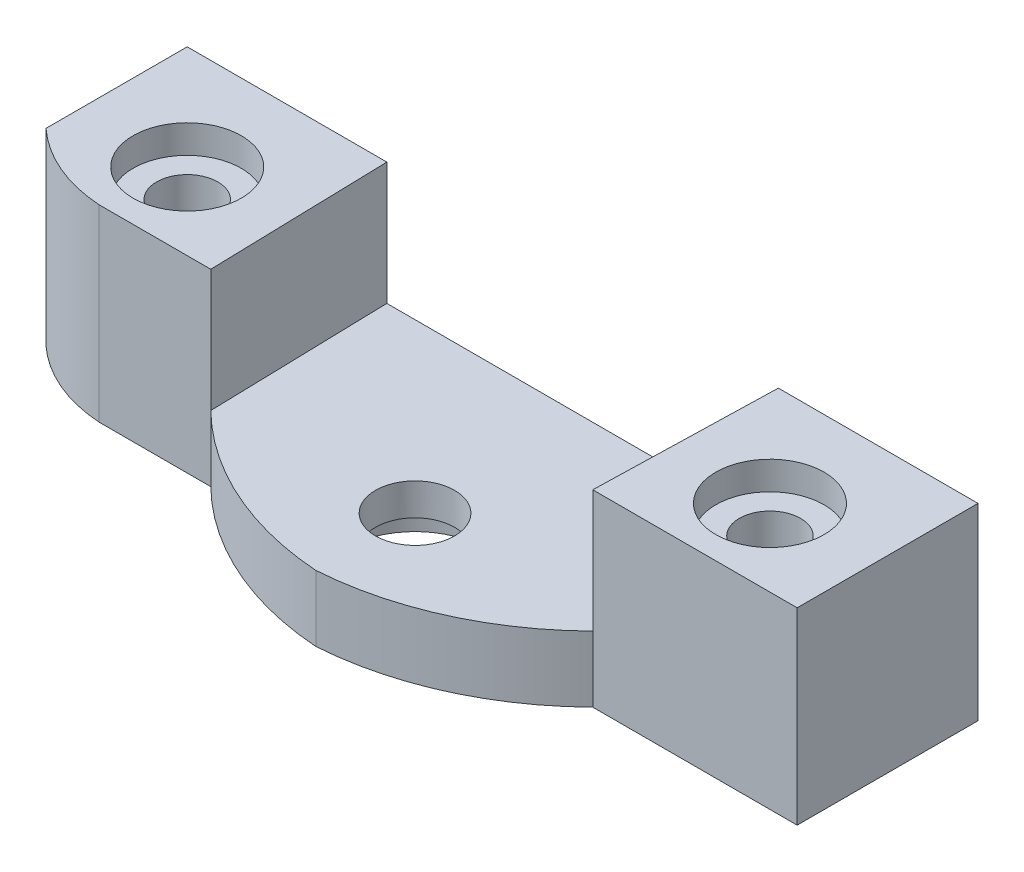
ISO-10303-21;
HEADER;
FILE_DESCRIPTION(('STEP AP214'),'2;1');
FILE_NAME('part.step','',(''),(''),'','','');
FILE_SCHEMA(('AUTOMOTIVE_DESIGN { 1 0 10303 214 1 1 1 1 }'));
ENDSEC;
DATA;
#1=APPLICATION_CONTEXT('core data for automotive mechanical design processes');
#2=APPLICATION_PROTOCOL_DEFINITION('international standard','automotive_design',2000,#1);
#3=PRODUCT_CONTEXT('',#1,'mechanical');
#4=PRODUCT('Part','Part','',(#3));
#5=PRODUCT_RELATED_PRODUCT_CATEGORY('part','',(#4));
#6=PRODUCT_DEFINITION_FORMATION('','',#4);
#7=PRODUCT_DEFINITION_CONTEXT('part definition',#1,'design');
#8=PRODUCT_DEFINITION('design','',#6,#7);
#9=PRODUCT_DEFINITION_SHAPE('','',#8);
#10=(LENGTH_UNIT() NAMED_UNIT(*) SI_UNIT(.MILLI.,.METRE.));
#11=(NAMED_UNIT(*) PLANE_ANGLE_UNIT() SI_UNIT($,.RADIAN.));
#12=(NAMED_UNIT(*) SI_UNIT($,.STERADIAN.) SOLID_ANGLE_UNIT());
#13=UNCERTAINTY_MEASURE_WITH_UNIT(LENGTH_MEASURE(1.E-05),#10,'distance_accuracy_value','');
#14=(GEOMETRIC_REPRESENTATION_CONTEXT(3) GLOBAL_UNCERTAINTY_ASSIGNED_CONTEXT((#13)) GLOBAL_UNIT_ASSIGNED_CONTEXT((#10,
#11,#12)) REPRESENTATION_CONTEXT('',''));
#15=CARTESIAN_POINT('',(0.,0.,0.));
#16=DIRECTION('',(0.,0.,1.));
#17=DIRECTION('',(1.,0.,0.));
#18=AXIS2_PLACEMENT_3D('',#15,#16,#17);
#19=CARTESIAN_POINT('',(0.,-0.999999999999999,3.9));
#20=DIRECTION('',(0.,1.,0.));
#21=DIRECTION('',(0.,0.,1.));
#22=AXIS2_PLACEMENT_3D('',#19,#20,#21);
#23=CYLINDRICAL_SURFACE('',#22,2.1);
#24=CARTESIAN_POINT('',(0.,3.5,3.9));
#25=DIRECTION('',(0.,1.,0.));
#26=DIRECTION('',(0.,0.,1.));
#27=AXIS2_PLACEMENT_3D('',#24,#25,#26);
#28=CIRCLE('',#27,2.1);
#29=CARTESIAN_POINT('',(0.,3.5,6.));
#30=VERTEX_POINT('',#29);
#31=EDGE_CURVE('E243',#30,#30,#28,.T.);
#32=ORIENTED_EDGE('',*,*,#31,.T.);
#33=EDGE_LOOP('',(#32));
#34=FACE_BOUND('',#33,.T.);
#35=CARTESIAN_POINT('',(0.,1.8,3.9));
#36=DIRECTION('',(0.,-1.,0.));
#37=DIRECTION('',(0.,0.,-1.));
#38=AXIS2_PLACEMENT_3D('',#35,#36,#37);
#39=CIRCLE('',#38,2.1);
#40=CARTESIAN_POINT('',(0.,1.8,1.8));
#41=VERTEX_POINT('',#40);
#42=EDGE_CURVE('E49',#41,#41,#39,.F.);
#43=ORIENTED_EDGE('',*,*,#42,.F.);
#44=EDGE_LOOP('',(#43));
#45=FACE_BOUND('',#44,.T.);
#46=ADVANCED_FACE('F45',(#34,#45),#23,.F.);
#47=CARTESIAN_POINT('',(0.,10.,0.));
#48=DIRECTION('',(0.,1.,0.));
#49=DIRECTION('',(0.,0.,1.));
#50=AXIS2_PLACEMENT_3D('',#47,#48,#49);
#51=PLANE('',#50);
#52=CARTESIAN_POINT('',(-15.475,10.,0.525));
#53=DIRECTION('',(0.,1.,0.));
#54=DIRECTION('',(0.,0.,1.));
#55=AXIS2_PLACEMENT_3D('',#52,#53,#54);
#56=CIRCLE('',#55,2.875);
#57=CARTESIAN_POINT('',(-15.475,10.,3.4));
#58=VERTEX_POINT('',#57);
#59=EDGE_CURVE('E209',#58,#58,#56,.T.);
#60=ORIENTED_EDGE('',*,*,#59,.F.);
#61=EDGE_LOOP('',(#60));
#62=FACE_BOUND('',#61,.T.);
#63=CARTESIAN_POINT('',(-15.5717814537107,10.,-3.3865068060365));
#64=DIRECTION('',(0.,-1.,0.));
#65=DIRECTION('',(0.,0.,-1.));
#66=AXIS2_PLACEMENT_3D('',#63,#64,#65);
#67=CIRCLE('',#66,8.00722567245859);
#68=CARTESIAN_POINT('',(-16.0708105718803,10.,4.60515340376339));
#69=VERTEX_POINT('',#68);
#70=CARTESIAN_POINT('',(-21.,10.,2.49992729139473));
#71=VERTEX_POINT('',#70);
#72=EDGE_CURVE('E62',#69,#71,#67,.T.);
#73=ORIENTED_EDGE('',*,*,#72,.F.);
#74=DIRECTION('',(1.,0.,0.));
#75=VECTOR('',#74,1.);
#76=CARTESIAN_POINT('',(0.,10.,4.60515340376339));
#77=LINE('',#76,#75);
#78=CARTESIAN_POINT('',(-10.1444972737664,10.,4.60515340376339));
#79=VERTEX_POINT('',#78);
#80=EDGE_CURVE('E145',#69,#79,#77,.T.);
#81=ORIENTED_EDGE('',*,*,#80,.T.);
#82=DIRECTION('',(-0.026249488815985,0.,-0.999655422801727));
#83=VECTOR('',#82,1.);
#84=CARTESIAN_POINT('',(-10.2583486226296,10.,0.269369225933365));
#85=LINE('',#84,#83);
#86=CARTESIAN_POINT('',(-10.3967145489363,10.,-5.));
#87=VERTEX_POINT('',#86);
#88=EDGE_CURVE('E216',#79,#87,#85,.T.);
#89=ORIENTED_EDGE('',*,*,#88,.T.);
#90=DIRECTION('',(-1.,0.,0.));
#91=VECTOR('',#90,1.);
#92=CARTESIAN_POINT('',(-21.,10.,-5.));
#93=LINE('',#92,#91);
#94=CARTESIAN_POINT('',(-21.,10.,-5.));
#95=VERTEX_POINT('',#94);
#96=EDGE_CURVE('E174',#87,#95,#93,.T.);
#97=ORIENTED_EDGE('',*,*,#96,.T.);
#98=DIRECTION('',(0.,0.,1.));
#99=VECTOR('',#98,1.);
#100=CARTESIAN_POINT('',(-21.,10.,-5.));
#101=LINE('',#100,#99);
#102=EDGE_CURVE('E179',#95,#71,#101,.T.);
#103=ORIENTED_EDGE('',*,*,#102,.T.);
#104=EDGE_LOOP('',(#73,#81,#89,#97,#103));
#105=FACE_BOUND('',#104,.T.);
#106=ADVANCED_FACE('F264',(#62,#105),#51,.T.);
#107=CARTESIAN_POINT('',(0.,0.,0.));
#108=DIRECTION('',(0.,1.,0.));
#109=DIRECTION('',(0.,0.,1.));
#110=AXIS2_PLACEMENT_3D('',#107,#108,#109);
#111=PLANE('',#110);
#112=CARTESIAN_POINT('',(0.,0.,3.9));
#113=DIRECTION('',(0.,-1.,0.));
#114=DIRECTION('',(0.,0.,-1.));
#115=AXIS2_PLACEMENT_3D('',#112,#113,#114);
#116=CIRCLE('',#115,3.75);
#117=CARTESIAN_POINT('',(0.,0.,0.149999999999999));
#118=VERTEX_POINT('',#117);
#119=EDGE_CURVE('E251',#118,#118,#116,.T.);
#120=ORIENTED_EDGE('',*,*,#119,.F.);
#121=EDGE_LOOP('',(#120));
#122=FACE_BOUND('',#121,.T.);
#123=CARTESIAN_POINT('',(15.475,0.,0.525));
#124=DIRECTION('',(0.,1.,0.));
#125=DIRECTION('',(0.,0.,1.));
#126=AXIS2_PLACEMENT_3D('',#123,#124,#125);
#127=CIRCLE('',#126,1.625);
#128=CARTESIAN_POINT('',(15.475,0.,2.15));
#129=VERTEX_POINT('',#128);
#130=EDGE_CURVE('E165',#129,#129,#127,.T.);
#131=ORIENTED_EDGE('',*,*,#130,.T.);
#132=EDGE_LOOP('',(#131));
#133=FACE_BOUND('',#132,.T.);
#134=CARTESIAN_POINT('',(-15.475,0.,0.525));
#135=DIRECTION('',(0.,1.,0.));
#136=DIRECTION('',(0.,0.,1.));
#137=AXIS2_PLACEMENT_3D('',#134,#135,#136);
#138=CIRCLE('',#137,1.625);
#139=CARTESIAN_POINT('',(-15.475,0.,2.15));
#140=VERTEX_POINT('',#139);
#141=EDGE_CURVE('E168',#140,#140,#138,.T.);
#142=ORIENTED_EDGE('',*,*,#141,.T.);
#143=EDGE_LOOP('',(#142));
#144=FACE_BOUND('',#143,.T.);
#145=DIRECTION('',(1.,0.,0.));
#146=VECTOR('',#145,1.);
#147=CARTESIAN_POINT('',(0.,0.,4.60515340376339));
#148=LINE('',#147,#146);
#149=CARTESIAN_POINT('',(-16.0708105718803,0.,4.60515340376339));
#150=VERTEX_POINT('',#149);
#151=CARTESIAN_POINT('',(-10.1444972737664,0.,4.60515340376339));
#152=VERTEX_POINT('',#151);
#153=EDGE_CURVE('E142',#150,#152,#148,.T.);
#154=ORIENTED_EDGE('',*,*,#153,.F.);
#155=CARTESIAN_POINT('',(-15.5717814537107,0.,-3.3865068060365));
#156=DIRECTION('',(0.,-1.,0.));
#157=DIRECTION('',(0.,0.,-1.));
#158=AXIS2_PLACEMENT_3D('',#155,#156,#157);
#159=CIRCLE('',#158,8.00722567245859);
#160=CARTESIAN_POINT('',(-21.,0.,2.49992729139473));
#161=VERTEX_POINT('',#160);
#162=EDGE_CURVE('E129',#150,#161,#159,.T.);
#163=ORIENTED_EDGE('',*,*,#162,.T.);
#164=DIRECTION('',(0.,0.,1.));
#165=VECTOR('',#164,1.);
#166=CARTESIAN_POINT('',(-21.,0.,-5.));
#167=LINE('',#166,#165);
#168=CARTESIAN_POINT('',(-21.,0.,-5.));
#169=VERTEX_POINT('',#168);
#170=EDGE_CURVE('E175',#169,#161,#167,.T.);
#171=ORIENTED_EDGE('',*,*,#170,.F.);
#172=DIRECTION('',(-1.,0.,0.));
#173=VECTOR('',#172,1.);
#174=CARTESIAN_POINT('',(-21.,0.,-5.));
#175=LINE('',#174,#173);
#176=CARTESIAN_POINT('',(21.,0.,-5.));
#177=VERTEX_POINT('',#176);
#178=EDGE_CURVE('E183',#177,#169,#175,.T.);
#179=ORIENTED_EDGE('',*,*,#178,.F.);
#180=DIRECTION('',(0.,0.,-1.));
#181=VECTOR('',#180,1.);
#182=CARTESIAN_POINT('',(21.,0.,-5.));
#183=LINE('',#182,#181);
#184=CARTESIAN_POINT('',(21.0000000000001,0.,4.60515340376319));
#185=VERTEX_POINT('',#184);
#186=EDGE_CURVE('E171',#185,#177,#183,.T.);
#187=ORIENTED_EDGE('',*,*,#186,.F.);
#188=DIRECTION('',(1.,0.,0.));
#189=VECTOR('',#188,1.);
#190=CARTESIAN_POINT('',(0.,0.,4.60515340376339));
#191=LINE('',#190,#189);
#192=CARTESIAN_POINT('',(10.1444972737664,0.,4.6051534037633));
#193=VERTEX_POINT('',#192);
#194=EDGE_CURVE('E161',#193,#185,#191,.T.);
#195=ORIENTED_EDGE('',*,*,#194,.F.);
#196=CARTESIAN_POINT('',(-1.09259437558827,0.,-6.82328402604807));
#197=DIRECTION('',(0.,1.,0.));
#198=DIRECTION('',(0.,0.,1.));
#199=AXIS2_PLACEMENT_3D('',#196,#197,#198);
#200=CIRCLE('',#199,16.0275204202994);
#201=CARTESIAN_POINT('',(0.,0.,9.16695200577911));
#202=VERTEX_POINT('',#201);
#203=EDGE_CURVE('E240',#202,#193,#200,.T.);
#204=ORIENTED_EDGE('',*,*,#203,.F.);
#205=CARTESIAN_POINT('',(1.09259437558826,0.,-6.82328402604807));
#206=DIRECTION('',(0.,1.,0.));
#207=DIRECTION('',(0.,0.,-1.));
#208=AXIS2_PLACEMENT_3D('',#205,#206,#207);
#209=CIRCLE('',#208,16.0275204202993);
#210=EDGE_CURVE('E150',#152,#202,#209,.T.);
#211=ORIENTED_EDGE('',*,*,#210,.F.);
#212=EDGE_LOOP('',(#154,#163,#171,#179,#187,#195,#204,#211));
#213=FACE_BOUND('',#212,.T.);
#214=ADVANCED_FACE('F148',(#122,#133,#144,#213),#111,.F.);
#215=CARTESIAN_POINT('',(21.0000000000001,13.5,4.60515340376319));
#216=DIRECTION('',(0.,0.,1.));
#217=DIRECTION('',(1.,0.,0.));
#218=AXIS2_PLACEMENT_3D('',#215,#216,#217);
#219=PLANE('',#218);
#220=DIRECTION('',(0.,1.,0.));
#221=VECTOR('',#220,1.);
#222=CARTESIAN_POINT('',(10.1444972737663,3.5,4.6051534037633));
#223=LINE('',#222,#221);
#224=CARTESIAN_POINT('',(10.1444972737665,10.,4.60515340376324));
#225=VERTEX_POINT('',#224);
#226=CARTESIAN_POINT('',(10.1444972737663,3.5,4.6051534037633));
#227=VERTEX_POINT('',#226);
#228=EDGE_CURVE('E151',#225,#227,#223,.F.);
#229=ORIENTED_EDGE('',*,*,#228,.T.);
#230=DIRECTION('',(0.,-1.,0.));
#231=VECTOR('',#230,1.);
#232=CARTESIAN_POINT('',(10.1444972737664,3.5,4.6051534037636));
#233=LINE('',#232,#231);
#234=EDGE_CURVE('E70',#227,#193,#233,.T.);
#235=ORIENTED_EDGE('',*,*,#234,.T.);
#236=ORIENTED_EDGE('',*,*,#194,.T.);
#237=DIRECTION('',(0.,-1.,0.));
#238=VECTOR('',#237,1.);
#239=CARTESIAN_POINT('',(21.0000000000001,13.5,4.60515340376319));
#240=LINE('',#239,#238);
#241=CARTESIAN_POINT('',(21.0000000000001,10.,4.60515340376319));
#242=VERTEX_POINT('',#241);
#243=EDGE_CURVE('E193',#242,#185,#240,.T.);
#244=ORIENTED_EDGE('',*,*,#243,.F.);
#245=DIRECTION('',(1.,0.,0.));
#246=VECTOR('',#245,1.);
#247=CARTESIAN_POINT('',(0.,10.,4.60515340376339));
#248=LINE('',#247,#246);
#249=EDGE_CURVE('E153',#225,#242,#248,.T.);
#250=ORIENTED_EDGE('',*,*,#249,.F.);
#251=EDGE_LOOP('',(#229,#235,#236,#244,#250));
#252=FACE_BOUND('',#251,.T.);
#253=ADVANCED_FACE('F313',(#252),#219,.T.);
#254=CARTESIAN_POINT('',(-21.,13.5,4.60515340376339));
#255=DIRECTION('',(0.,0.,1.));
#256=DIRECTION('',(1.,0.,0.));
#257=AXIS2_PLACEMENT_3D('',#254,#255,#256);
#258=PLANE('',#257);
#259=DIRECTION('',(0.,1.,0.));
#260=VECTOR('',#259,1.);
#261=CARTESIAN_POINT('',(-16.0708105718803,0.,4.60515340376339));
#262=LINE('',#261,#260);
#263=EDGE_CURVE('E132',#150,#69,#262,.T.);
#264=ORIENTED_EDGE('',*,*,#263,.F.);
#265=ORIENTED_EDGE('',*,*,#153,.T.);
#266=DIRECTION('',(0.,-1.,0.));
#267=VECTOR('',#266,1.);
#268=CARTESIAN_POINT('',(-10.1444972737664,3.5,4.60515340376339));
#269=LINE('',#268,#267);
#270=CARTESIAN_POINT('',(-10.1444972737664,3.5,4.60515340376339));
#271=VERTEX_POINT('',#270);
#272=EDGE_CURVE('E232',#271,#152,#269,.T.);
#273=ORIENTED_EDGE('',*,*,#272,.F.);
#274=DIRECTION('',(0.,1.,0.));
#275=VECTOR('',#274,1.);
#276=CARTESIAN_POINT('',(-10.1444972737664,3.5,4.60515340376339));
#277=LINE('',#276,#275);
#278=EDGE_CURVE('E155',#271,#79,#277,.T.);
#279=ORIENTED_EDGE('',*,*,#278,.T.);
#280=ORIENTED_EDGE('',*,*,#80,.F.);
#281=EDGE_LOOP('',(#264,#265,#273,#279,#280));
#282=FACE_BOUND('',#281,.T.);
#283=ADVANCED_FACE('F141',(#282),#258,.T.);
#284=CARTESIAN_POINT('',(15.475,10.,0.524999999999869));
#285=DIRECTION('',(0.,1.,0.));
#286=DIRECTION('',(0.,0.,-1.));
#287=AXIS2_PLACEMENT_3D('',#284,#285,#286);
#288=CIRCLE('',#287,2.875);
#289=CARTESIAN_POINT('',(15.475,10.,-2.35000000000013));
#290=VERTEX_POINT('',#289);
#291=EDGE_CURVE('E205',#290,#290,#288,.T.);
#292=ORIENTED_EDGE('',*,*,#291,.F.);
#293=EDGE_LOOP('',(#292));
#294=FACE_BOUND('',#293,.T.);
#295=CARTESIAN_POINT('',(21.,10.,-5.));
#296=VERTEX_POINT('',#295);
#297=CARTESIAN_POINT('',(10.3967145489363,10.,-5.));
#298=VERTEX_POINT('',#297);
#299=EDGE_CURVE('E176',#296,#298,#93,.T.);
#300=ORIENTED_EDGE('',*,*,#299,.T.);
#301=DIRECTION('',(-0.0262494888159706,0.,0.999655422801727));
#302=VECTOR('',#301,1.);
#303=CARTESIAN_POINT('',(10.2583486226297,10.,0.269369225933219));
#304=LINE('',#303,#302);
#305=EDGE_CURVE('E206',#298,#225,#304,.T.);
#306=ORIENTED_EDGE('',*,*,#305,.T.);
#307=ORIENTED_EDGE('',*,*,#249,.T.);
#308=DIRECTION('',(0.,0.,-1.));
#309=VECTOR('',#308,1.);
#310=CARTESIAN_POINT('',(21.,10.,-5.));
#311=LINE('',#310,#309);
#312=EDGE_CURVE('E172',#242,#296,#311,.T.);
#313=ORIENTED_EDGE('',*,*,#312,.T.);
#314=EDGE_LOOP('',(#300,#306,#307,#313));
#315=FACE_BOUND('',#314,.T.);
#316=ADVANCED_FACE('F274',(#294,#315),#51,.T.);
#317=CARTESIAN_POINT('',(-21.,10.,-5.));
#318=DIRECTION('',(0.,0.,1.));
#319=DIRECTION('',(1.,0.,0.));
#320=AXIS2_PLACEMENT_3D('',#317,#318,#319);
#321=PLANE('',#320);
#322=DIRECTION('',(0.,-1.,0.));
#323=VECTOR('',#322,1.);
#324=CARTESIAN_POINT('',(-10.3967145489363,11.5,-5.));
#325=LINE('',#324,#323);
#326=CARTESIAN_POINT('',(-10.3967145489363,3.5,-5.));
#327=VERTEX_POINT('',#326);
#328=EDGE_CURVE('E219',#87,#327,#325,.T.);
#329=ORIENTED_EDGE('',*,*,#328,.T.);
#330=DIRECTION('',(-1.,0.,0.));
#331=VECTOR('',#330,1.);
#332=CARTESIAN_POINT('',(-21.,3.5,-5.));
#333=LINE('',#332,#331);
#334=CARTESIAN_POINT('',(10.3967145489363,3.5,-5.));
#335=VERTEX_POINT('',#334);
#336=EDGE_CURVE('E163',#335,#327,#333,.T.);
#337=ORIENTED_EDGE('',*,*,#336,.F.);
#338=DIRECTION('',(0.,-1.,0.));
#339=VECTOR('',#338,1.);
#340=CARTESIAN_POINT('',(10.3967145489363,11.5,-5.));
#341=LINE('',#340,#339);
#342=EDGE_CURVE('E224',#298,#335,#341,.T.);
#343=ORIENTED_EDGE('',*,*,#342,.F.);
#344=ORIENTED_EDGE('',*,*,#299,.F.);
#345=DIRECTION('',(0.,-1.,0.));
#346=VECTOR('',#345,1.);
#347=CARTESIAN_POINT('',(21.,10.,-5.));
#348=LINE('',#347,#346);
#349=EDGE_CURVE('E11',#296,#177,#348,.T.);
#350=ORIENTED_EDGE('',*,*,#349,.T.);
#351=ORIENTED_EDGE('',*,*,#178,.T.);
#352=DIRECTION('',(0.,-1.,0.));
#353=VECTOR('',#352,1.);
#354=CARTESIAN_POINT('',(-21.,10.,-5.));
#355=LINE('',#354,#353);
#356=EDGE_CURVE('E54',#95,#169,#355,.T.);
#357=ORIENTED_EDGE('',*,*,#356,.F.);
#358=ORIENTED_EDGE('',*,*,#96,.F.);
#359=EDGE_LOOP('',(#329,#337,#343,#344,#350,#351,#357,#358));
#360=FACE_BOUND('',#359,.T.);
#361=ADVANCED_FACE('F326',(#360),#321,.F.);
#362=CARTESIAN_POINT('',(-15.475,10.,0.525));
#363=DIRECTION('',(0.,-1.,0.));
#364=DIRECTION('',(0.,0.,-1.));
#365=AXIS2_PLACEMENT_3D('',#362,#363,#364);
#366=CYLINDRICAL_SURFACE('',#365,1.625);
#367=ORIENTED_EDGE('',*,*,#141,.F.);
#368=EDGE_LOOP('',(#367));
#369=FACE_BOUND('',#368,.T.);
#370=CARTESIAN_POINT('',(-15.475,8.5,0.525));
#371=DIRECTION('',(0.,1.,0.));
#372=DIRECTION('',(0.,0.,1.));
#373=AXIS2_PLACEMENT_3D('',#370,#371,#372);
#374=CIRCLE('',#373,1.625);
#375=CARTESIAN_POINT('',(-15.475,8.5,2.15));
#376=VERTEX_POINT('',#375);
#377=EDGE_CURVE('E190',#376,#376,#374,.T.);
#378=ORIENTED_EDGE('',*,*,#377,.T.);
#379=EDGE_LOOP('',(#378));
#380=FACE_BOUND('',#379,.T.);
#381=ADVANCED_FACE('F324',(#369,#380),#366,.F.);
#382=CARTESIAN_POINT('',(21.,10.,-5.));
#383=DIRECTION('',(-1.,0.,0.));
#384=DIRECTION('',(0.,0.,1.));
#385=AXIS2_PLACEMENT_3D('',#382,#383,#384);
#386=PLANE('',#385);
#387=ORIENTED_EDGE('',*,*,#243,.T.);
#388=ORIENTED_EDGE('',*,*,#186,.T.);
#389=ORIENTED_EDGE('',*,*,#349,.F.);
#390=ORIENTED_EDGE('',*,*,#312,.F.);
#391=EDGE_LOOP('',(#387,#388,#389,#390));
#392=FACE_BOUND('',#391,.T.);
#393=ADVANCED_FACE('F47',(#392),#386,.F.);
#394=CARTESIAN_POINT('',(-21.,10.,-5.));
#395=DIRECTION('',(1.,0.,0.));
#396=DIRECTION('',(0.,0.,-1.));
#397=AXIS2_PLACEMENT_3D('',#394,#395,#396);
#398=PLANE('',#397);
#399=ORIENTED_EDGE('',*,*,#170,.T.);
#400=DIRECTION('',(0.,1.,0.));
#401=VECTOR('',#400,1.);
#402=CARTESIAN_POINT('',(-21.,0.,2.49992729139473));
#403=LINE('',#402,#401);
#404=EDGE_CURVE('E133',#161,#71,#403,.T.);
#405=ORIENTED_EDGE('',*,*,#404,.T.);
#406=ORIENTED_EDGE('',*,*,#102,.F.);
#407=ORIENTED_EDGE('',*,*,#356,.T.);
#408=EDGE_LOOP('',(#399,#405,#406,#407));
#409=FACE_BOUND('',#408,.T.);
#410=ADVANCED_FACE('F319',(#409),#398,.F.);
#411=CARTESIAN_POINT('',(0.,3.5,5.));
#412=DIRECTION('',(0.,1.,0.));
#413=DIRECTION('',(0.,0.,1.));
#414=AXIS2_PLACEMENT_3D('',#411,#412,#413);
#415=PLANE('',#414);
#416=ORIENTED_EDGE('',*,*,#31,.F.);
#417=EDGE_LOOP('',(#416));
#418=FACE_BOUND('',#417,.T.);
#419=CARTESIAN_POINT('',(-1.09259437558827,3.5,-6.82328402604807));
#420=DIRECTION('',(0.,1.,0.));
#421=DIRECTION('',(0.,0.,1.));
#422=AXIS2_PLACEMENT_3D('',#419,#420,#421);
#423=CIRCLE('',#422,16.0275204202994);
#424=CARTESIAN_POINT('',(0.,3.5,9.16695200577911));
#425=VERTEX_POINT('',#424);
#426=EDGE_CURVE('E239',#425,#227,#423,.T.);
#427=ORIENTED_EDGE('',*,*,#426,.T.);
#428=DIRECTION('',(0.0262494888159706,0.,-0.999655422801727));
#429=VECTOR('',#428,1.);
#430=CARTESIAN_POINT('',(10.1444972737665,3.5,4.60515340376324));
#431=LINE('',#430,#429);
#432=EDGE_CURVE('E220',#227,#335,#431,.T.);
#433=ORIENTED_EDGE('',*,*,#432,.T.);
#434=ORIENTED_EDGE('',*,*,#336,.T.);
#435=DIRECTION('',(0.026249488815985,0.,0.999655422801727));
#436=VECTOR('',#435,1.);
#437=CARTESIAN_POINT('',(-10.1444972737664,3.5,4.60515340376339));
#438=LINE('',#437,#436);
#439=EDGE_CURVE('E223',#327,#271,#438,.T.);
#440=ORIENTED_EDGE('',*,*,#439,.T.);
#441=CARTESIAN_POINT('',(1.09259437558826,3.5,-6.82328402604807));
#442=DIRECTION('',(0.,1.,0.));
#443=DIRECTION('',(0.,0.,-1.));
#444=AXIS2_PLACEMENT_3D('',#441,#442,#443);
#445=CIRCLE('',#444,16.0275204202993);
#446=EDGE_CURVE('E237',#271,#425,#445,.T.);
#447=ORIENTED_EDGE('',*,*,#446,.T.);
#448=EDGE_LOOP('',(#427,#433,#434,#440,#447));
#449=FACE_BOUND('',#448,.T.);
#450=ADVANCED_FACE('F316',(#418,#449),#415,.T.);
#451=CARTESIAN_POINT('',(15.475,10.,0.525));
#452=DIRECTION('',(0.,-1.,0.));
#453=DIRECTION('',(0.,0.,-1.));
#454=AXIS2_PLACEMENT_3D('',#451,#452,#453);
#455=CYLINDRICAL_SURFACE('',#454,1.625);
#456=CARTESIAN_POINT('',(15.475,8.5,0.525));
#457=DIRECTION('',(0.,-1.,0.));
#458=DIRECTION('',(0.,0.,-1.));
#459=AXIS2_PLACEMENT_3D('',#456,#457,#458);
#460=CIRCLE('',#459,1.625);
#461=CARTESIAN_POINT('',(15.475,8.5,-1.1));
#462=VERTEX_POINT('',#461);
#463=EDGE_CURVE('E188',#462,#462,#460,.T.);
#464=ORIENTED_EDGE('',*,*,#463,.F.);
#465=EDGE_LOOP('',(#464));
#466=FACE_BOUND('',#465,.T.);
#467=ORIENTED_EDGE('',*,*,#130,.F.);
#468=EDGE_LOOP('',(#467));
#469=FACE_BOUND('',#468,.T.);
#470=ADVANCED_FACE('F306',(#466,#469),#455,.F.);
#471=CARTESIAN_POINT('',(15.475,8.5,0.524999999999869));
#472=DIRECTION('',(0.,1.,0.));
#473=DIRECTION('',(0.,0.,1.));
#474=AXIS2_PLACEMENT_3D('',#471,#472,#473);
#475=CYLINDRICAL_SURFACE('',#474,2.875);
#476=CARTESIAN_POINT('',(15.475,8.5,0.524999999999869));
#477=DIRECTION('',(0.,1.,0.));
#478=DIRECTION('',(0.,0.,-1.));
#479=AXIS2_PLACEMENT_3D('',#476,#477,#478);
#480=CIRCLE('',#479,2.875);
#481=CARTESIAN_POINT('',(15.475,8.5,-2.35000000000013));
#482=VERTEX_POINT('',#481);
#483=EDGE_CURVE('E202',#482,#482,#480,.T.);
#484=ORIENTED_EDGE('',*,*,#483,.F.);
#485=EDGE_LOOP('',(#484));
#486=FACE_BOUND('',#485,.T.);
#487=ORIENTED_EDGE('',*,*,#291,.T.);
#488=EDGE_LOOP('',(#487));
#489=FACE_BOUND('',#488,.T.);
#490=ADVANCED_FACE('F303',(#486,#489),#475,.F.);
#491=CARTESIAN_POINT('',(15.475,8.5,0.524999999999869));
#492=DIRECTION('',(0.,-1.,0.));
#493=DIRECTION('',(0.,0.,-1.));
#494=AXIS2_PLACEMENT_3D('',#491,#492,#493);
#495=PLANE('',#494);
#496=ORIENTED_EDGE('',*,*,#463,.T.);
#497=EDGE_LOOP('',(#496));
#498=FACE_BOUND('',#497,.T.);
#499=ORIENTED_EDGE('',*,*,#483,.T.);
#500=EDGE_LOOP('',(#499));
#501=FACE_BOUND('',#500,.T.);
#502=ADVANCED_FACE('F301',(#498,#501),#495,.F.);
#503=CARTESIAN_POINT('',(-15.475,8.5,0.525));
#504=DIRECTION('',(0.,1.,0.));
#505=DIRECTION('',(0.,0.,1.));
#506=AXIS2_PLACEMENT_3D('',#503,#504,#505);
#507=CYLINDRICAL_SURFACE('',#506,2.875);
#508=CARTESIAN_POINT('',(-15.475,8.5,0.525));
#509=DIRECTION('',(0.,1.,0.));
#510=DIRECTION('',(0.,0.,1.));
#511=AXIS2_PLACEMENT_3D('',#508,#509,#510);
#512=CIRCLE('',#511,2.875);
#513=CARTESIAN_POINT('',(-15.475,8.5,3.4));
#514=VERTEX_POINT('',#513);
#515=EDGE_CURVE('E191',#514,#514,#512,.T.);
#516=ORIENTED_EDGE('',*,*,#515,.F.);
#517=EDGE_LOOP('',(#516));
#518=FACE_BOUND('',#517,.T.);
#519=ORIENTED_EDGE('',*,*,#59,.T.);
#520=EDGE_LOOP('',(#519));
#521=FACE_BOUND('',#520,.T.);
#522=ADVANCED_FACE('F297',(#518,#521),#507,.F.);
#523=CARTESIAN_POINT('',(-15.475,8.5,0.525));
#524=DIRECTION('',(0.,1.,0.));
#525=DIRECTION('',(0.,0.,1.));
#526=AXIS2_PLACEMENT_3D('',#523,#524,#525);
#527=PLANE('',#526);
#528=ORIENTED_EDGE('',*,*,#377,.F.);
#529=EDGE_LOOP('',(#528));
#530=FACE_BOUND('',#529,.T.);
#531=ORIENTED_EDGE('',*,*,#515,.T.);
#532=EDGE_LOOP('',(#531));
#533=FACE_BOUND('',#532,.T.);
#534=ADVANCED_FACE('F290',(#530,#533),#527,.T.);
#535=CARTESIAN_POINT('',(-10.1444972737664,11.5,4.60515340376339));
#536=DIRECTION('',(0.999655422801727,0.,-0.026249488815985));
#537=DIRECTION('',(-0.026249488815985,0.,-0.999655422801727));
#538=AXIS2_PLACEMENT_3D('',#535,#536,#537);
#539=PLANE('',#538);
#540=ORIENTED_EDGE('',*,*,#278,.F.);
#541=ORIENTED_EDGE('',*,*,#439,.F.);
#542=ORIENTED_EDGE('',*,*,#328,.F.);
#543=ORIENTED_EDGE('',*,*,#88,.F.);
#544=EDGE_LOOP('',(#540,#541,#542,#543));
#545=FACE_BOUND('',#544,.T.);
#546=ADVANCED_FACE('F287',(#545),#539,.T.);
#547=CARTESIAN_POINT('',(10.1444972737665,11.5,4.60515340376324));
#548=DIRECTION('',(-0.999655422801727,0.,-0.0262494888159706));
#549=DIRECTION('',(-0.0262494888159706,0.,0.999655422801727));
#550=AXIS2_PLACEMENT_3D('',#547,#548,#549);
#551=PLANE('',#550);
#552=ORIENTED_EDGE('',*,*,#342,.T.);
#553=ORIENTED_EDGE('',*,*,#432,.F.);
#554=ORIENTED_EDGE('',*,*,#228,.F.);
#555=ORIENTED_EDGE('',*,*,#305,.F.);
#556=EDGE_LOOP('',(#552,#553,#554,#555));
#557=FACE_BOUND('',#556,.T.);
#558=ADVANCED_FACE('F285',(#557),#551,.T.);
#559=CARTESIAN_POINT('',(-1.09259437558827,3.5,-6.82328402604807));
#560=DIRECTION('',(0.,-1.,0.));
#561=DIRECTION('',(0.,0.,-1.));
#562=AXIS2_PLACEMENT_3D('',#559,#560,#561);
#563=CYLINDRICAL_SURFACE('',#562,16.0275204202994);
#564=ORIENTED_EDGE('',*,*,#203,.T.);
#565=ORIENTED_EDGE('',*,*,#234,.F.);
#566=ORIENTED_EDGE('',*,*,#426,.F.);
#567=DIRECTION('',(0.,-1.,0.));
#568=VECTOR('',#567,1.);
#569=CARTESIAN_POINT('',(0.,3.5,9.16695200577911));
#570=LINE('',#569,#568);
#571=EDGE_CURVE('E234',#425,#202,#570,.T.);
#572=ORIENTED_EDGE('',*,*,#571,.T.);
#573=EDGE_LOOP('',(#564,#565,#566,#572));
#574=FACE_BOUND('',#573,.T.);
#575=ADVANCED_FACE('F281',(#574),#563,.T.);
#576=CARTESIAN_POINT('',(1.09259437558826,3.5,-6.82328402604807));
#577=DIRECTION('',(0.,-1.,0.));
#578=DIRECTION('',(0.,0.,-1.));
#579=AXIS2_PLACEMENT_3D('',#576,#577,#578);
#580=CYLINDRICAL_SURFACE('',#579,16.0275204202993);
#581=ORIENTED_EDGE('',*,*,#210,.T.);
#582=ORIENTED_EDGE('',*,*,#571,.F.);
#583=ORIENTED_EDGE('',*,*,#446,.F.);
#584=ORIENTED_EDGE('',*,*,#272,.T.);
#585=EDGE_LOOP('',(#581,#582,#583,#584));
#586=FACE_BOUND('',#585,.T.);
#587=ADVANCED_FACE('F278',(#586),#580,.T.);
#588=CARTESIAN_POINT('',(-15.5717814537107,0.,-3.3865068060365));
#589=DIRECTION('',(0.,1.,0.));
#590=DIRECTION('',(0.,0.,1.));
#591=AXIS2_PLACEMENT_3D('',#588,#589,#590);
#592=CYLINDRICAL_SURFACE('',#591,8.00722567245859);
#593=ORIENTED_EDGE('',*,*,#72,.T.);
#594=ORIENTED_EDGE('',*,*,#404,.F.);
#595=ORIENTED_EDGE('',*,*,#162,.F.);
#596=ORIENTED_EDGE('',*,*,#263,.T.);
#597=EDGE_LOOP('',(#593,#594,#595,#596));
#598=FACE_BOUND('',#597,.T.);
#599=ADVANCED_FACE('F131',(#598),#592,.T.);
#600=CARTESIAN_POINT('',(0.,1.8,3.9));
#601=DIRECTION('',(0.,-1.,0.));
#602=DIRECTION('',(0.,0.,-1.));
#603=AXIS2_PLACEMENT_3D('',#600,#601,#602);
#604=PLANE('',#603);
#605=CARTESIAN_POINT('',(0.,1.8,3.9));
#606=DIRECTION('',(0.,-1.,0.));
#607=DIRECTION('',(0.,0.,-1.));
#608=AXIS2_PLACEMENT_3D('',#605,#606,#607);
#609=CIRCLE('',#608,3.75);
#610=CARTESIAN_POINT('',(0.,1.8,0.149999999999999));
#611=VERTEX_POINT('',#610);
#612=EDGE_CURVE('E254',#611,#611,#609,.T.);
#613=ORIENTED_EDGE('',*,*,#612,.T.);
#614=EDGE_LOOP('',(#613));
#615=FACE_BOUND('',#614,.T.);
#616=ORIENTED_EDGE('',*,*,#42,.T.);
#617=EDGE_LOOP('',(#616));
#618=FACE_BOUND('',#617,.T.);
#619=ADVANCED_FACE('F261',(#615,#618),#604,.T.);
#620=CARTESIAN_POINT('',(0.,1.8,3.9));
#621=DIRECTION('',(0.,-1.,0.));
#622=DIRECTION('',(0.,0.,-1.));
#623=AXIS2_PLACEMENT_3D('',#620,#621,#622);
#624=CYLINDRICAL_SURFACE('',#623,3.75);
#625=ORIENTED_EDGE('',*,*,#612,.F.);
#626=EDGE_LOOP('',(#625));
#627=FACE_BOUND('',#626,.T.);
#628=ORIENTED_EDGE('',*,*,#119,.T.);
#629=EDGE_LOOP('',(#628));
#630=FACE_BOUND('',#629,.T.);
#631=ADVANCED_FACE('F461',(#627,#630),#624,.F.);
#632=CLOSED_SHELL('',(#46,#106,#214,#253,#283,#316,#361,#381,#393,#410,#450,#470,#490,#502,#522,
#534,#546,#558,#575,#587,#599,#619,#631));
#633=MANIFOLD_SOLID_BREP('B2',#632);
#634=ADVANCED_BREP_SHAPE_REPRESENTATION('',(#18,#633),#14);
#635=SHAPE_DEFINITION_REPRESENTATION(#9,#634);
ENDSEC;
END-ISO-10303-21;
